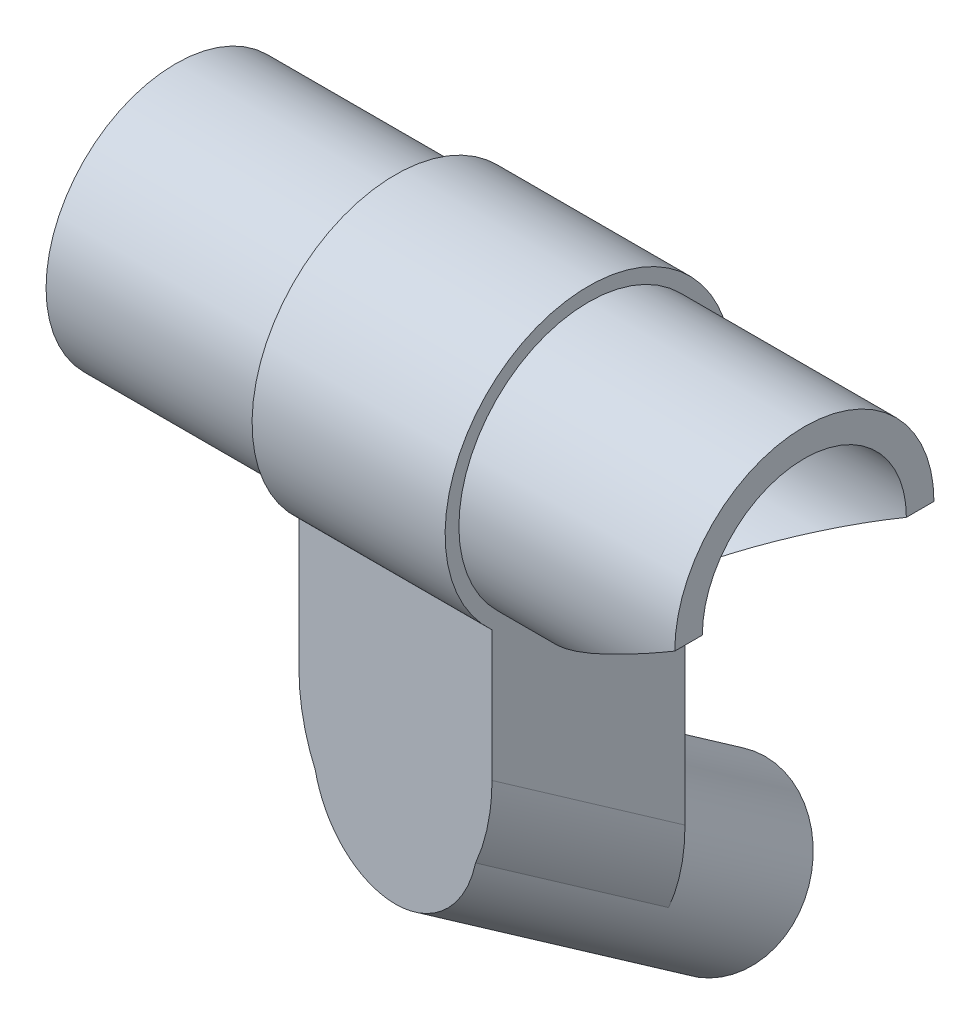
ISO-10303-21;
HEADER;
FILE_DESCRIPTION(('STEP AP214'),'2;1');
FILE_NAME('part.step','',(''),(''),'','','');
FILE_SCHEMA(('AUTOMOTIVE_DESIGN { 1 0 10303 214 1 1 1 1 }'));
ENDSEC;
DATA;
#1=APPLICATION_CONTEXT('core data for automotive mechanical design processes');
#2=APPLICATION_PROTOCOL_DEFINITION('international standard','automotive_design',2000,#1);
#3=PRODUCT_CONTEXT('',#1,'mechanical');
#4=PRODUCT('Part','Part','',(#3));
#5=PRODUCT_RELATED_PRODUCT_CATEGORY('part','',(#4));
#6=PRODUCT_DEFINITION_FORMATION('','',#4);
#7=PRODUCT_DEFINITION_CONTEXT('part definition',#1,'design');
#8=PRODUCT_DEFINITION('design','',#6,#7);
#9=PRODUCT_DEFINITION_SHAPE('','',#8);
#10=(LENGTH_UNIT() NAMED_UNIT(*) SI_UNIT(.MILLI.,.METRE.));
#11=(NAMED_UNIT(*) PLANE_ANGLE_UNIT() SI_UNIT($,.RADIAN.));
#12=(NAMED_UNIT(*) SI_UNIT($,.STERADIAN.) SOLID_ANGLE_UNIT());
#13=UNCERTAINTY_MEASURE_WITH_UNIT(LENGTH_MEASURE(1.E-05),#10,'distance_accuracy_value','');
#14=(GEOMETRIC_REPRESENTATION_CONTEXT(3) GLOBAL_UNCERTAINTY_ASSIGNED_CONTEXT((#13)) GLOBAL_UNIT_ASSIGNED_CONTEXT((#10,
#11,#12)) REPRESENTATION_CONTEXT('',''));
#15=CARTESIAN_POINT('',(0.,0.,0.));
#16=DIRECTION('',(0.,0.,1.));
#17=DIRECTION('',(1.,0.,0.));
#18=AXIS2_PLACEMENT_3D('',#15,#16,#17);
#19=CARTESIAN_POINT('',(114.,0.,0.));
#20=DIRECTION('',(-1.,0.,0.));
#21=DIRECTION('',(0.,0.,1.));
#22=AXIS2_PLACEMENT_3D('',#19,#20,#21);
#23=CYLINDRICAL_SURFACE('',#22,23.5);
#24=CARTESIAN_POINT('',(114.,0.,0.));
#25=DIRECTION('',(-0.506549048630866,0.862211146605728,0.));
#26=DIRECTION('',(-0.862211146605728,-0.506549048630866,0.));
#27=AXIS2_PLACEMENT_3D('',#24,#25,#26);
#28=ELLIPSE('',#27,46.3923485070545,23.5);
#29=CARTESIAN_POINT('',(114.,0.,-23.5));
#30=VERTEX_POINT('',#29);
#31=CARTESIAN_POINT('',(74.857864376269,-22.996004678942,-4.84084381137014));
#32=VERTEX_POINT('',#31);
#33=EDGE_CURVE('E228',#30,#32,#28,.T.);
#34=ORIENTED_EDGE('',*,*,#33,.T.);
#35=CARTESIAN_POINT('',(74.857864376269,0.,0.));
#36=DIRECTION('',(1.,0.,0.));
#37=DIRECTION('',(0.,0.,-1.));
#38=AXIS2_PLACEMENT_3D('',#35,#36,#37);
#39=CIRCLE('',#38,23.5);
#40=CARTESIAN_POINT('',(74.857864376269,-22.996004678942,4.84084381137014));
#41=VERTEX_POINT('',#40);
#42=EDGE_CURVE('E156',#32,#41,#39,.T.);
#43=ORIENTED_EDGE('',*,*,#42,.T.);
#44=CARTESIAN_POINT('',(114.,0.,23.5));
#45=VERTEX_POINT('',#44);
#46=EDGE_CURVE('E223',#41,#45,#28,.T.);
#47=ORIENTED_EDGE('',*,*,#46,.T.);
#48=CARTESIAN_POINT('',(114.,0.,0.));
#49=DIRECTION('',(1.,0.,0.));
#50=DIRECTION('',(0.,0.,-1.));
#51=AXIS2_PLACEMENT_3D('',#48,#49,#50);
#52=CIRCLE('',#51,23.5);
#53=EDGE_CURVE('E220',#30,#45,#52,.T.);
#54=ORIENTED_EDGE('',*,*,#53,.F.);
#55=EDGE_LOOP('',(#34,#43,#47,#54));
#56=FACE_BOUND('',#55,.T.);
#57=ADVANCED_FACE('F41',(#56),#23,.T.);
#58=CARTESIAN_POINT('',(57.3578643762691,-53.528471272979,16.3830408857798));
#59=DIRECTION('',(0.,-0.573576436351047,-0.819152044288991));
#60=DIRECTION('',(0.,0.819152044288991,-0.573576436351047));
#61=AXIS2_PLACEMENT_3D('',#58,#59,#60);
#62=CYLINDRICAL_SURFACE('',#61,15.);
#63=CARTESIAN_POINT('',(57.3578643762691,-52.74636808133,17.5));
#64=DIRECTION('',(0.,0.,-1.));
#65=DIRECTION('',(0.,-1.,0.));
#66=AXIS2_PLACEMENT_3D('',#63,#64,#65);
#67=ELLIPSE('',#66,18.3116188314219,15.);
#68=CARTESIAN_POINT('',(42.8328248813325,-57.3178759650479,17.5));
#69=VERTEX_POINT('',#68);
#70=CARTESIAN_POINT('',(71.8801980875455,-57.3306690174823,17.5));
#71=VERTEX_POINT('',#70);
#72=EDGE_CURVE('E114',#69,#71,#67,.F.);
#73=ORIENTED_EDGE('',*,*,#72,.F.);
#74=DIRECTION('',(0.,-0.573576436351047,-0.819152044288991));
#75=VECTOR('',#74,1.);
#76=CARTESIAN_POINT('',(42.8328248813325,-56.5959991056397,18.530946997877));
#77=LINE('',#76,#75);
#78=CARTESIAN_POINT('',(42.8328248813324,-81.8251398023878,-17.5));
#79=VERTEX_POINT('',#78);
#80=EDGE_CURVE('E124',#69,#79,#77,.T.);
#81=ORIENTED_EDGE('',*,*,#80,.T.);
#82=CARTESIAN_POINT('',(57.357864376269,-77.25363191867,-17.5));
#83=DIRECTION('',(0.,0.,-1.));
#84=DIRECTION('',(0.,-1.,0.));
#85=AXIS2_PLACEMENT_3D('',#82,#83,#84);
#86=ELLIPSE('',#85,18.3116188314219,15.);
#87=CARTESIAN_POINT('',(71.8801980875453,-81.8379328548222,-17.5));
#88=VERTEX_POINT('',#87);
#89=EDGE_CURVE('E160',#79,#88,#86,.T.);
#90=ORIENTED_EDGE('',*,*,#89,.T.);
#91=DIRECTION('',(0.,-0.573576436351047,-0.819152044288991));
#92=VECTOR('',#91,1.);
#93=CARTESIAN_POINT('',(71.8801980875455,-56.6045833726706,18.5369577663619));
#94=LINE('',#93,#92);
#95=EDGE_CURVE('E126',#88,#71,#94,.F.);
#96=ORIENTED_EDGE('',*,*,#95,.T.);
#97=EDGE_LOOP('',(#73,#81,#90,#96));
#98=FACE_BOUND('',#97,.T.);
#99=CARTESIAN_POINT('',(57.3578643762689,-93.6788218175524,-40.9576022144496));
#100=DIRECTION('',(0.,-0.573576436351047,-0.819152044288991));
#101=DIRECTION('',(0.,0.819152044288991,-0.573576436351047));
#102=AXIS2_PLACEMENT_3D('',#99,#100,#101);
#103=CIRCLE('',#102,15.);
#104=CARTESIAN_POINT('',(57.3578643762689,-81.3915411532175,-49.5612487597153));
#105=VERTEX_POINT('',#104);
#106=EDGE_CURVE('E168',#105,#105,#103,.T.);
#107=ORIENTED_EDGE('',*,*,#106,.F.);
#108=EDGE_LOOP('',(#107));
#109=FACE_BOUND('',#108,.T.);
#110=ADVANCED_FACE('F121',(#98,#109),#62,.T.);
#111=CARTESIAN_POINT('',(57.3578643762691,-53.528471272979,16.3830408857798));
#112=DIRECTION('',(0.,-0.573576436351047,-0.819152044288991));
#113=DIRECTION('',(0.,0.819152044288991,-0.573576436351047));
#114=AXIS2_PLACEMENT_3D('',#111,#112,#113);
#115=CYLINDRICAL_SURFACE('',#114,12.5);
#116=CARTESIAN_POINT('',(57.3578643762689,-93.6788218175524,-40.9576022144496));
#117=DIRECTION('',(0.,-0.573576436351047,-0.819152044288991));
#118=DIRECTION('',(0.,0.819152044288991,-0.573576436351047));
#119=AXIS2_PLACEMENT_3D('',#116,#117,#118);
#120=CIRCLE('',#119,12.5);
#121=CARTESIAN_POINT('',(57.3578643762689,-83.43942126394,-48.1273076688376));
#122=VERTEX_POINT('',#121);
#123=EDGE_CURVE('E296',#122,#122,#120,.T.);
#124=ORIENTED_EDGE('',*,*,#123,.T.);
#125=EDGE_LOOP('',(#124));
#126=FACE_BOUND('',#125,.T.);
#127=CARTESIAN_POINT('',(57.357864376269,-77.25363191867,-17.5));
#128=DIRECTION('',(0.,0.,-1.));
#129=DIRECTION('',(0.,-1.,0.));
#130=AXIS2_PLACEMENT_3D('',#127,#128,#129);
#131=ELLIPSE('',#130,15.2596823595182,12.5);
#132=CARTESIAN_POINT('',(57.3578643762689,-92.5133142781882,-17.5));
#133=VERTEX_POINT('',#132);
#134=EDGE_CURVE('E163',#133,#133,#131,.T.);
#135=ORIENTED_EDGE('',*,*,#134,.F.);
#136=EDGE_LOOP('',(#135));
#137=FACE_BOUND('',#136,.T.);
#138=ADVANCED_FACE('F270',(#126,#137),#115,.F.);
#139=CARTESIAN_POINT('',(39.857864376269,-65.,-17.5));
#140=DIRECTION('',(0.,0.,-1.));
#141=DIRECTION('',(-1.,0.,0.));
#142=AXIS2_PLACEMENT_3D('',#139,#140,#141);
#143=PLANE('',#142);
#144=ORIENTED_EDGE('',*,*,#134,.T.);
#145=EDGE_LOOP('',(#144));
#146=FACE_BOUND('',#145,.T.);
#147=ADVANCED_FACE('F259',(#146),#143,.T.);
#148=CARTESIAN_POINT('',(5.,0.,0.));
#149=DIRECTION('',(-1.,0.,0.));
#150=DIRECTION('',(0.,0.,1.));
#151=AXIS2_PLACEMENT_3D('',#148,#149,#150);
#152=CYLINDRICAL_SURFACE('',#151,5.37499999999997);
#153=CARTESIAN_POINT('',(0.,0.,0.));
#154=DIRECTION('',(-1.,0.,0.));
#155=DIRECTION('',(0.,0.,1.));
#156=AXIS2_PLACEMENT_3D('',#153,#154,#155);
#157=CIRCLE('',#156,5.37499999999997);
#158=CARTESIAN_POINT('',(0.,0.,5.37499999999997));
#159=VERTEX_POINT('',#158);
#160=EDGE_CURVE('E210',#159,#159,#157,.T.);
#161=ORIENTED_EDGE('',*,*,#160,.T.);
#162=EDGE_LOOP('',(#161));
#163=FACE_BOUND('',#162,.T.);
#164=CARTESIAN_POINT('',(2.5,0.,0.));
#165=DIRECTION('',(1.,0.,0.));
#166=DIRECTION('',(0.,0.,-1.));
#167=AXIS2_PLACEMENT_3D('',#164,#165,#166);
#168=CIRCLE('',#167,5.37499999999997);
#169=CARTESIAN_POINT('',(2.5,0.,-5.37499999999997));
#170=VERTEX_POINT('',#169);
#171=EDGE_CURVE('E180',#170,#170,#168,.F.);
#172=ORIENTED_EDGE('',*,*,#171,.F.);
#173=EDGE_LOOP('',(#172));
#174=FACE_BOUND('',#173,.T.);
#175=ADVANCED_FACE('F248',(#163,#174),#152,.F.);
#176=CARTESIAN_POINT('',(114.,0.,0.));
#177=DIRECTION('',(-1.,0.,0.));
#178=DIRECTION('',(0.,0.,1.));
#179=AXIS2_PLACEMENT_3D('',#176,#177,#178);
#180=CYLINDRICAL_SURFACE('',#179,18.5);
#181=CARTESIAN_POINT('',(5.,0.,0.));
#182=DIRECTION('',(-1.,0.,0.));
#183=DIRECTION('',(0.,0.,1.));
#184=AXIS2_PLACEMENT_3D('',#181,#182,#183);
#185=CIRCLE('',#184,18.5);
#186=CARTESIAN_POINT('',(5.,0.,18.5));
#187=VERTEX_POINT('',#186);
#188=EDGE_CURVE('E215',#187,#187,#185,.T.);
#189=ORIENTED_EDGE('',*,*,#188,.T.);
#190=EDGE_LOOP('',(#189));
#191=FACE_BOUND('',#190,.T.);
#192=CARTESIAN_POINT('',(114.,0.,0.));
#193=DIRECTION('',(-0.506549048630866,0.862211146605728,0.));
#194=DIRECTION('',(-0.862211146605728,-0.506549048630866,0.));
#195=AXIS2_PLACEMENT_3D('',#192,#193,#194);
#196=ELLIPSE('',#195,36.521636058745,18.5);
#197=CARTESIAN_POINT('',(114.,0.,-18.5));
#198=VERTEX_POINT('',#197);
#199=CARTESIAN_POINT('',(114.,0.,18.5));
#200=VERTEX_POINT('',#199);
#201=EDGE_CURVE('E185',#198,#200,#196,.T.);
#202=ORIENTED_EDGE('',*,*,#201,.F.);
#203=CARTESIAN_POINT('',(114.,0.,0.));
#204=DIRECTION('',(1.,0.,0.));
#205=DIRECTION('',(0.,0.,-1.));
#206=AXIS2_PLACEMENT_3D('',#203,#204,#205);
#207=CIRCLE('',#206,18.5);
#208=EDGE_CURVE('E216',#198,#200,#207,.T.);
#209=ORIENTED_EDGE('',*,*,#208,.T.);
#210=EDGE_LOOP('',(#202,#209));
#211=FACE_BOUND('',#210,.T.);
#212=ADVANCED_FACE('F246',(#191,#211),#180,.F.);
#213=CARTESIAN_POINT('',(114.,0.,0.));
#214=DIRECTION('',(1.,0.,0.));
#215=DIRECTION('',(0.,0.,-1.));
#216=AXIS2_PLACEMENT_3D('',#213,#214,#215);
#217=PLANE('',#216);
#218=DIRECTION('',(0.,0.,1.));
#219=VECTOR('',#218,1.);
#220=CARTESIAN_POINT('',(114.,0.,-23.5));
#221=LINE('',#220,#219);
#222=EDGE_CURVE('E183',#30,#198,#221,.T.);
#223=ORIENTED_EDGE('',*,*,#222,.F.);
#224=ORIENTED_EDGE('',*,*,#53,.T.);
#225=EDGE_CURVE('E186',#200,#45,#221,.T.);
#226=ORIENTED_EDGE('',*,*,#225,.F.);
#227=ORIENTED_EDGE('',*,*,#208,.F.);
#228=EDGE_LOOP('',(#223,#224,#226,#227));
#229=FACE_BOUND('',#228,.T.);
#230=ADVANCED_FACE('F242',(#229),#217,.T.);
#231=CARTESIAN_POINT('',(0.,0.,0.));
#232=DIRECTION('',(1.,0.,0.));
#233=DIRECTION('',(0.,0.,-1.));
#234=AXIS2_PLACEMENT_3D('',#231,#232,#233);
#235=PLANE('',#234);
#236=CARTESIAN_POINT('',(0.,0.,0.));
#237=DIRECTION('',(1.,0.,0.));
#238=DIRECTION('',(0.,0.,-1.));
#239=AXIS2_PLACEMENT_3D('',#236,#237,#238);
#240=CIRCLE('',#239,23.5);
#241=CARTESIAN_POINT('',(0.,0.,23.5));
#242=VERTEX_POINT('',#241);
#243=EDGE_CURVE('E219',#242,#242,#240,.T.);
#244=ORIENTED_EDGE('',*,*,#243,.F.);
#245=EDGE_LOOP('',(#244));
#246=FACE_BOUND('',#245,.T.);
#247=ORIENTED_EDGE('',*,*,#160,.F.);
#248=EDGE_LOOP('',(#247));
#249=FACE_BOUND('',#248,.T.);
#250=CARTESIAN_POINT('',(0.,6.35166331923901,-12.4762323269907));
#251=DIRECTION('',(-1.,0.,0.));
#252=DIRECTION('',(0.,0.,1.));
#253=AXIS2_PLACEMENT_3D('',#250,#251,#252);
#254=CIRCLE('',#253,1.24999999999999);
#255=CARTESIAN_POINT('',(0.,6.35166331923901,-11.2262323269907));
#256=VERTEX_POINT('',#255);
#257=EDGE_CURVE('E204',#256,#256,#254,.T.);
#258=ORIENTED_EDGE('',*,*,#257,.F.);
#259=EDGE_LOOP('',(#258));
#260=FACE_BOUND('',#259,.T.);
#261=CARTESIAN_POINT('',(0.,-12.4762323270948,-6.35166331923473));
#262=DIRECTION('',(-1.,0.,0.));
#263=DIRECTION('',(0.,0.,1.));
#264=AXIS2_PLACEMENT_3D('',#261,#262,#263);
#265=CIRCLE('',#264,1.24999999999999);
#266=CARTESIAN_POINT('',(0.,-12.4762323270948,-5.10166331923475));
#267=VERTEX_POINT('',#266);
#268=EDGE_CURVE('E198',#267,#267,#265,.T.);
#269=ORIENTED_EDGE('',*,*,#268,.F.);
#270=EDGE_LOOP('',(#269));
#271=FACE_BOUND('',#270,.T.);
#272=CARTESIAN_POINT('',(0.,-6.35166331933882,12.4762323270991));
#273=DIRECTION('',(-1.,0.,0.));
#274=DIRECTION('',(0.,0.,1.));
#275=AXIS2_PLACEMENT_3D('',#272,#273,#274);
#276=CIRCLE('',#275,1.24999999999999);
#277=CARTESIAN_POINT('',(0.,-6.35166331933882,13.726232327099));
#278=VERTEX_POINT('',#277);
#279=EDGE_CURVE('E192',#278,#278,#276,.T.);
#280=ORIENTED_EDGE('',*,*,#279,.F.);
#281=EDGE_LOOP('',(#280));
#282=FACE_BOUND('',#281,.T.);
#283=CARTESIAN_POINT('',(0.,12.476232326995,6.35166331934309));
#284=DIRECTION('',(-1.,0.,0.));
#285=DIRECTION('',(0.,0.,1.));
#286=AXIS2_PLACEMENT_3D('',#283,#284,#285);
#287=CIRCLE('',#286,1.24999999999999);
#288=CARTESIAN_POINT('',(0.,12.476232326995,7.60166331934308));
#289=VERTEX_POINT('',#288);
#290=EDGE_CURVE('E188',#289,#289,#287,.T.);
#291=ORIENTED_EDGE('',*,*,#290,.F.);
#292=EDGE_LOOP('',(#291));
#293=FACE_BOUND('',#292,.T.);
#294=ADVANCED_FACE('F256',(#246,#249,#260,#271,#282,#293),#235,.F.);
#295=CARTESIAN_POINT('',(39.857864376269,0.,0.));
#296=DIRECTION('',(-1.,0.,0.));
#297=DIRECTION('',(0.,0.,1.));
#298=AXIS2_PLACEMENT_3D('',#295,#296,#297);
#299=CIRCLE('',#298,23.5);
#300=CARTESIAN_POINT('',(39.8578643762691,0.,23.5));
#301=VERTEX_POINT('',#300);
#302=EDGE_CURVE('E130',#301,#301,#299,.T.);
#303=CARTESIAN_POINT('',(0.,0.,23.5));
#304=CARTESIAN_POINT('',(0.415186087252805,0.,23.5));
#305=CARTESIAN_POINT('',(0.83037217450561,0.,23.5));
#306=CARTESIAN_POINT('',(1.66074434901121,0.,23.5));
#307=CARTESIAN_POINT('',(2.07593043626401,0.,23.5));
#308=CARTESIAN_POINT('',(2.90630261076962,0.,23.5));
#309=CARTESIAN_POINT('',(3.32148869802242,0.,23.5));
#310=CARTESIAN_POINT('',(4.15186087252803,0.,23.5));
#311=CARTESIAN_POINT('',(4.56704695978083,0.,23.5));
#312=CARTESIAN_POINT('',(5.39741913428643,0.,23.5));
#313=CARTESIAN_POINT('',(5.81260522153924,0.,23.5));
#314=CARTESIAN_POINT('',(6.64297739604484,0.,23.5));
#315=CARTESIAN_POINT('',(7.05816348329764,0.,23.5));
#316=CARTESIAN_POINT('',(7.88853565780325,0.,23.5));
#317=CARTESIAN_POINT('',(8.30372174505605,0.,23.5));
#318=CARTESIAN_POINT('',(9.13409391956166,0.,23.5));
#319=CARTESIAN_POINT('',(9.54928000681446,0.,23.5));
#320=CARTESIAN_POINT('',(10.3796521813201,0.,23.5));
#321=CARTESIAN_POINT('',(10.7948382685729,0.,23.5));
#322=CARTESIAN_POINT('',(11.6252104430785,0.,23.5));
#323=CARTESIAN_POINT('',(12.0403965303313,0.,23.5));
#324=CARTESIAN_POINT('',(12.8707687048369,0.,23.5));
#325=CARTESIAN_POINT('',(13.2859547920897,0.,23.5));
#326=CARTESIAN_POINT('',(14.1163269665953,0.,23.5));
#327=CARTESIAN_POINT('',(14.5315130538481,0.,23.5));
#328=CARTESIAN_POINT('',(15.3618852283537,0.,23.5));
#329=CARTESIAN_POINT('',(15.7770713156065,0.,23.5));
#330=CARTESIAN_POINT('',(16.6074434901121,0.,23.5));
#331=CARTESIAN_POINT('',(17.0226295773649,0.,23.5));
#332=CARTESIAN_POINT('',(17.8530017518705,0.,23.5));
#333=CARTESIAN_POINT('',(18.2681878391233,0.,23.5));
#334=CARTESIAN_POINT('',(19.0985600136289,0.,23.5));
#335=CARTESIAN_POINT('',(19.5137461008817,0.,23.5));
#336=CARTESIAN_POINT('',(20.3441182753873,0.,23.5));
#337=CARTESIAN_POINT('',(20.7593043626401,0.,23.5));
#338=CARTESIAN_POINT('',(21.5896765371457,0.,23.5));
#339=CARTESIAN_POINT('',(22.0048626243985,0.,23.5));
#340=CARTESIAN_POINT('',(22.8352347989041,0.,23.5));
#341=CARTESIAN_POINT('',(23.250420886157,0.,23.5));
#342=CARTESIAN_POINT('',(24.0807930606626,0.,23.5));
#343=CARTESIAN_POINT('',(24.4959791479154,0.,23.5));
#344=CARTESIAN_POINT('',(25.326351322421,0.,23.5));
#345=CARTESIAN_POINT('',(25.7415374096738,0.,23.5));
#346=CARTESIAN_POINT('',(26.5719095841794,0.,23.5));
#347=CARTESIAN_POINT('',(26.9870956714322,0.,23.5));
#348=CARTESIAN_POINT('',(27.8174678459378,0.,23.5));
#349=CARTESIAN_POINT('',(28.2326539331906,0.,23.5));
#350=CARTESIAN_POINT('',(29.0630261076962,0.,23.5));
#351=CARTESIAN_POINT('',(29.478212194949,0.,23.5));
#352=CARTESIAN_POINT('',(30.3085843694546,0.,23.5));
#353=CARTESIAN_POINT('',(30.7237704567074,0.,23.5));
#354=CARTESIAN_POINT('',(31.554142631213,0.,23.5));
#355=CARTESIAN_POINT('',(31.9693287184658,0.,23.5));
#356=CARTESIAN_POINT('',(32.7997008929714,0.,23.5));
#357=CARTESIAN_POINT('',(33.2148869802242,0.,23.5));
#358=CARTESIAN_POINT('',(34.0452591547298,0.,23.5));
#359=CARTESIAN_POINT('',(34.4604452419826,0.,23.5));
#360=CARTESIAN_POINT('',(35.2908174164882,0.,23.5));
#361=CARTESIAN_POINT('',(35.706003503741,0.,23.5));
#362=CARTESIAN_POINT('',(36.5363756782466,0.,23.5));
#363=CARTESIAN_POINT('',(36.9515617654994,0.,23.5));
#364=CARTESIAN_POINT('',(37.7819339400051,0.,23.5));
#365=CARTESIAN_POINT('',(38.1971200272579,0.,23.5));
#366=CARTESIAN_POINT('',(39.0274922017635,0.,23.5));
#367=CARTESIAN_POINT('',(39.4426782890163,0.,23.5));
#368=CARTESIAN_POINT('',(39.8578643762691,0.,23.5));
#369=B_SPLINE_CURVE_WITH_KNOTS('',3,(#303,#304,#305,#306,#307,#308,#309,#310,#311,#312,#313,
#314,#315,#316,#317,#318,#319,#320,#321,#322,#323,#324,#325,#326,#327,#328,#329,#330,#331,#332,
#333,#334,#335,#336,#337,#338,#339,#340,#341,#342,#343,#344,#345,#346,#347,#348,#349,#350,#351,
#352,#353,#354,#355,#356,#357,#358,#359,#360,#361,#362,#363,#364,#365,#366,#367,#368),
.UNSPECIFIED.,.F.,.F.,(4,2,2,2,2,2,2,2,2,2,2,2,2,2,2,2,2,2,2,2,2,2,2,2,2,2,2,2,2,2,2,2,4),(0.,
1.24555826175841,2.49111652351681,3.73667478527523,4.98223304703363,6.22779130879204,
7.47334957055044,8.71890783230886,9.96446609406726,11.2100243558257,12.4555826175841,
13.7011408793425,14.9466991411009,16.1922574028593,17.4378156646177,18.6833739263761,
19.9289321881345,21.1744904498929,22.4200487116513,23.6656069734098,24.9111652351682,
26.1567234969266,27.402281758685,28.6478400204434,29.8933982822018,31.1389565439602,
32.3845148057186,33.630073067477,34.8756313292354,36.1211895909938,37.3667478527522,
38.6123061145107,39.8578643762691),.UNSPECIFIED.);
#370=EDGE_CURVE('BSEAM265',#242,#301,#369,.T.);
#371=ORIENTED_EDGE('',*,*,#243,.T.);
#372=ORIENTED_EDGE('',*,*,#302,.T.);
#373=ORIENTED_EDGE('',*,*,#370,.T.);
#374=ORIENTED_EDGE('',*,*,#370,.F.);
#375=EDGE_LOOP('',(#371,#373,#372,#374));
#376=FACE_BOUND('',#375,.T.);
#377=ADVANCED_FACE('F265',(#376),#23,.T.);
#378=CARTESIAN_POINT('',(5.,0.,0.));
#379=DIRECTION('',(-1.,0.,0.));
#380=DIRECTION('',(0.,0.,1.));
#381=AXIS2_PLACEMENT_3D('',#378,#379,#380);
#382=PLANE('',#381);
#383=CARTESIAN_POINT('',(5.,-4.99034579325564E-11,5.41864209752108E-11));
#384=DIRECTION('',(1.,0.,0.));
#385=DIRECTION('',(0.,0.,-1.));
#386=AXIS2_PLACEMENT_3D('',#383,#384,#385);
#387=CIRCLE('',#386,11.5000000000663);
#388=CARTESIAN_POINT('',(5.,-4.99034579325564E-11,-11.5000000000121));
#389=VERTEX_POINT('',#388);
#390=EDGE_CURVE('E176',#389,#389,#387,.T.);
#391=ORIENTED_EDGE('',*,*,#390,.F.);
#392=EDGE_LOOP('',(#391));
#393=FACE_BOUND('',#392,.T.);
#394=CARTESIAN_POINT('',(5.,6.35166331923901,-12.4762323269907));
#395=DIRECTION('',(-1.,0.,0.));
#396=DIRECTION('',(0.,0.,1.));
#397=AXIS2_PLACEMENT_3D('',#394,#395,#396);
#398=CIRCLE('',#397,1.24999999999999);
#399=CARTESIAN_POINT('',(5.,6.35166331923901,-11.2262323269907));
#400=VERTEX_POINT('',#399);
#401=EDGE_CURVE('E207',#400,#400,#398,.T.);
#402=ORIENTED_EDGE('',*,*,#401,.T.);
#403=EDGE_LOOP('',(#402));
#404=FACE_BOUND('',#403,.T.);
#405=CARTESIAN_POINT('',(5.,-12.4762323270948,-6.35166331923473));
#406=DIRECTION('',(-1.,0.,0.));
#407=DIRECTION('',(0.,0.,1.));
#408=AXIS2_PLACEMENT_3D('',#405,#406,#407);
#409=CIRCLE('',#408,1.24999999999999);
#410=CARTESIAN_POINT('',(5.,-12.4762323270948,-5.10166331923475));
#411=VERTEX_POINT('',#410);
#412=EDGE_CURVE('E201',#411,#411,#409,.T.);
#413=ORIENTED_EDGE('',*,*,#412,.T.);
#414=EDGE_LOOP('',(#413));
#415=FACE_BOUND('',#414,.T.);
#416=CARTESIAN_POINT('',(5.,-6.35166331933882,12.4762323270991));
#417=DIRECTION('',(-1.,0.,0.));
#418=DIRECTION('',(0.,0.,1.));
#419=AXIS2_PLACEMENT_3D('',#416,#417,#418);
#420=CIRCLE('',#419,1.24999999999999);
#421=CARTESIAN_POINT('',(5.,-6.35166331933882,13.726232327099));
#422=VERTEX_POINT('',#421);
#423=EDGE_CURVE('E195',#422,#422,#420,.T.);
#424=ORIENTED_EDGE('',*,*,#423,.T.);
#425=EDGE_LOOP('',(#424));
#426=FACE_BOUND('',#425,.T.);
#427=CARTESIAN_POINT('',(5.,12.476232326995,6.35166331934309));
#428=DIRECTION('',(-1.,0.,0.));
#429=DIRECTION('',(0.,0.,1.));
#430=AXIS2_PLACEMENT_3D('',#427,#428,#429);
#431=CIRCLE('',#430,1.24999999999999);
#432=CARTESIAN_POINT('',(5.,12.476232326995,7.60166331934308));
#433=VERTEX_POINT('',#432);
#434=EDGE_CURVE('E189',#433,#433,#431,.T.);
#435=ORIENTED_EDGE('',*,*,#434,.T.);
#436=EDGE_LOOP('',(#435));
#437=FACE_BOUND('',#436,.T.);
#438=ORIENTED_EDGE('',*,*,#188,.F.);
#439=EDGE_LOOP('',(#438));
#440=FACE_BOUND('',#439,.T.);
#441=ADVANCED_FACE('F273',(#393,#404,#415,#426,#437,#440),#382,.F.);
#442=CARTESIAN_POINT('',(5.,6.35166331923901,-12.4762323269907));
#443=DIRECTION('',(-1.,0.,0.));
#444=DIRECTION('',(0.,0.,1.));
#445=AXIS2_PLACEMENT_3D('',#442,#443,#444);
#446=CYLINDRICAL_SURFACE('',#445,1.24999999999999);
#447=ORIENTED_EDGE('',*,*,#401,.F.);
#448=EDGE_LOOP('',(#447));
#449=FACE_BOUND('',#448,.T.);
#450=ORIENTED_EDGE('',*,*,#257,.T.);
#451=EDGE_LOOP('',(#450));
#452=FACE_BOUND('',#451,.T.);
#453=ADVANCED_FACE('F278',(#449,#452),#446,.F.);
#454=CARTESIAN_POINT('',(5.,-12.4762323270948,-6.35166331923473));
#455=DIRECTION('',(-1.,0.,0.));
#456=DIRECTION('',(0.,0.,1.));
#457=AXIS2_PLACEMENT_3D('',#454,#455,#456);
#458=CYLINDRICAL_SURFACE('',#457,1.24999999999999);
#459=ORIENTED_EDGE('',*,*,#412,.F.);
#460=EDGE_LOOP('',(#459));
#461=FACE_BOUND('',#460,.T.);
#462=ORIENTED_EDGE('',*,*,#268,.T.);
#463=EDGE_LOOP('',(#462));
#464=FACE_BOUND('',#463,.T.);
#465=ADVANCED_FACE('F338',(#461,#464),#458,.F.);
#466=CARTESIAN_POINT('',(5.,-6.35166331933882,12.4762323270991));
#467=DIRECTION('',(-1.,0.,0.));
#468=DIRECTION('',(0.,0.,1.));
#469=AXIS2_PLACEMENT_3D('',#466,#467,#468);
#470=CYLINDRICAL_SURFACE('',#469,1.24999999999999);
#471=ORIENTED_EDGE('',*,*,#423,.F.);
#472=EDGE_LOOP('',(#471));
#473=FACE_BOUND('',#472,.T.);
#474=ORIENTED_EDGE('',*,*,#279,.T.);
#475=EDGE_LOOP('',(#474));
#476=FACE_BOUND('',#475,.T.);
#477=ADVANCED_FACE('F334',(#473,#476),#470,.F.);
#478=CARTESIAN_POINT('',(5.,12.476232326995,6.35166331934309));
#479=DIRECTION('',(-1.,0.,0.));
#480=DIRECTION('',(0.,0.,1.));
#481=AXIS2_PLACEMENT_3D('',#478,#479,#480);
#482=CYLINDRICAL_SURFACE('',#481,1.24999999999999);
#483=ORIENTED_EDGE('',*,*,#434,.F.);
#484=EDGE_LOOP('',(#483));
#485=FACE_BOUND('',#484,.T.);
#486=ORIENTED_EDGE('',*,*,#290,.T.);
#487=EDGE_LOOP('',(#486));
#488=FACE_BOUND('',#487,.T.);
#489=ADVANCED_FACE('F331',(#485,#488),#482,.F.);
#490=CARTESIAN_POINT('',(114.,0.,-23.5));
#491=DIRECTION('',(-0.506549048630866,0.862211146605728,0.));
#492=DIRECTION('',(-0.862211146605728,-0.506549048630866,0.));
#493=AXIS2_PLACEMENT_3D('',#490,#491,#492);
#494=PLANE('',#493);
#495=ORIENTED_EDGE('',*,*,#46,.F.);
#496=DIRECTION('',(0.,0.,-1.));
#497=VECTOR('',#496,1.);
#498=CARTESIAN_POINT('',(74.857864376269,-22.996004678942,-23.5));
#499=LINE('',#498,#497);
#500=EDGE_CURVE('E135',#41,#32,#499,.T.);
#501=ORIENTED_EDGE('',*,*,#500,.T.);
#502=ORIENTED_EDGE('',*,*,#33,.F.);
#503=ORIENTED_EDGE('',*,*,#222,.T.);
#504=ORIENTED_EDGE('',*,*,#201,.T.);
#505=ORIENTED_EDGE('',*,*,#225,.T.);
#506=EDGE_LOOP('',(#495,#501,#502,#503,#504,#505));
#507=FACE_BOUND('',#506,.T.);
#508=ADVANCED_FACE('F235',(#507),#494,.F.);
#509=CARTESIAN_POINT('',(2.5,-4.99034579325564E-11,5.41864209752108E-11));
#510=DIRECTION('',(1.,0.,0.));
#511=DIRECTION('',(0.,0.,-1.));
#512=AXIS2_PLACEMENT_3D('',#509,#510,#511);
#513=PLANE('',#512);
#514=CARTESIAN_POINT('',(2.5,-4.99034579325564E-11,5.41864209752108E-11));
#515=DIRECTION('',(1.,0.,0.));
#516=DIRECTION('',(0.,0.,-1.));
#517=AXIS2_PLACEMENT_3D('',#514,#515,#516);
#518=CIRCLE('',#517,11.5000000000663);
#519=CARTESIAN_POINT('',(2.5,-4.99034579325564E-11,-11.5000000000121));
#520=VERTEX_POINT('',#519);
#521=EDGE_CURVE('E177',#520,#520,#518,.T.);
#522=ORIENTED_EDGE('',*,*,#521,.T.);
#523=EDGE_LOOP('',(#522));
#524=FACE_BOUND('',#523,.T.);
#525=ORIENTED_EDGE('',*,*,#171,.T.);
#526=EDGE_LOOP('',(#525));
#527=FACE_BOUND('',#526,.T.);
#528=ADVANCED_FACE('F322',(#524,#527),#513,.T.);
#529=CARTESIAN_POINT('',(2.5,-4.99034579325564E-11,5.41864209752108E-11));
#530=DIRECTION('',(1.,0.,0.));
#531=DIRECTION('',(0.,0.,-1.));
#532=AXIS2_PLACEMENT_3D('',#529,#530,#531);
#533=CYLINDRICAL_SURFACE('',#532,11.5000000000663);
#534=ORIENTED_EDGE('',*,*,#521,.F.);
#535=EDGE_LOOP('',(#534));
#536=FACE_BOUND('',#535,.T.);
#537=ORIENTED_EDGE('',*,*,#390,.T.);
#538=EDGE_LOOP('',(#537));
#539=FACE_BOUND('',#538,.T.);
#540=ADVANCED_FACE('F321',(#536,#539),#533,.F.);
#541=CARTESIAN_POINT('',(74.857864376269,-65.,-17.5));
#542=DIRECTION('',(1.,0.,0.));
#543=DIRECTION('',(0.,0.,-1.));
#544=AXIS2_PLACEMENT_3D('',#541,#542,#543);
#545=PLANE('',#544);
#546=DIRECTION('',(0.,1.,0.));
#547=VECTOR('',#546,1.);
#548=CARTESIAN_POINT('',(74.857864376269,-65.,17.5));
#549=LINE('',#548,#547);
#550=CARTESIAN_POINT('',(74.8578643762691,-42.8854017270823,17.5));
#551=VERTEX_POINT('',#550);
#552=CARTESIAN_POINT('',(74.857864376269,-19.2288845230294,17.5));
#553=VERTEX_POINT('',#552);
#554=EDGE_CURVE('E146',#551,#553,#549,.T.);
#555=ORIENTED_EDGE('',*,*,#554,.F.);
#556=DIRECTION('',(0.,0.573576436351047,0.819152044288991));
#557=VECTOR('',#556,1.);
#558=CARTESIAN_POINT('',(74.857864376269,-71.219364596069,-22.9650925944482));
#559=LINE('',#558,#557);
#560=CARTESIAN_POINT('',(74.8578643762689,-67.3926655644222,-17.5));
#561=VERTEX_POINT('',#560);
#562=EDGE_CURVE('E141',#551,#561,#559,.F.);
#563=ORIENTED_EDGE('',*,*,#562,.T.);
#564=DIRECTION('',(0.,1.,0.));
#565=VECTOR('',#564,1.);
#566=CARTESIAN_POINT('',(74.857864376269,-65.,-17.5));
#567=LINE('',#566,#565);
#568=CARTESIAN_POINT('',(74.857864376269,-19.2288845230294,-17.5));
#569=VERTEX_POINT('',#568);
#570=EDGE_CURVE('E162',#561,#569,#567,.T.);
#571=ORIENTED_EDGE('',*,*,#570,.T.);
#572=CARTESIAN_POINT('',(74.857864376269,0.,0.));
#573=DIRECTION('',(-1.,0.,0.));
#574=DIRECTION('',(0.,0.,1.));
#575=AXIS2_PLACEMENT_3D('',#572,#573,#574);
#576=CIRCLE('',#575,26.);
#577=EDGE_CURVE('E155',#553,#569,#576,.T.);
#578=ORIENTED_EDGE('',*,*,#577,.F.);
#579=EDGE_LOOP('',(#555,#563,#571,#578));
#580=FACE_BOUND('',#579,.T.);
#581=ORIENTED_EDGE('',*,*,#42,.F.);
#582=ORIENTED_EDGE('',*,*,#500,.F.);
#583=EDGE_LOOP('',(#581,#582));
#584=FACE_BOUND('',#583,.T.);
#585=ADVANCED_FACE('F151',(#580,#584),#545,.T.);
#586=ORIENTED_EDGE('',*,*,#570,.F.);
#587=CARTESIAN_POINT('',(49.8578643762689,-67.3926655644223,-17.5));
#588=DIRECTION('',(0.,0.,-1.));
#589=DIRECTION('',(0.,-1.,0.));
#590=AXIS2_PLACEMENT_3D('',#587,#588,#589);
#591=ELLIPSE('',#590,30.5193647190364,25.);
#592=EDGE_CURVE('E118',#561,#88,#591,.T.);
#593=ORIENTED_EDGE('',*,*,#592,.T.);
#594=ORIENTED_EDGE('',*,*,#89,.F.);
#595=CARTESIAN_POINT('',(64.8578643762689,-67.3860217445001,-17.5));
#596=DIRECTION('',(0.,0.,-1.));
#597=DIRECTION('',(0.,-1.,0.));
#598=AXIS2_PLACEMENT_3D('',#595,#596,#597);
#599=ELLIPSE('',#598,30.5193647190364,25.);
#600=CARTESIAN_POINT('',(39.8578643762689,-67.3860217445002,-17.5));
#601=VERTEX_POINT('',#600);
#602=EDGE_CURVE('E63',#79,#601,#599,.T.);
#603=ORIENTED_EDGE('',*,*,#602,.T.);
#604=DIRECTION('',(0.,1.,0.));
#605=VECTOR('',#604,1.);
#606=CARTESIAN_POINT('',(39.857864376269,-65.,-17.5));
#607=LINE('',#606,#605);
#608=CARTESIAN_POINT('',(39.857864376269,-19.2288845230294,-17.5));
#609=VERTEX_POINT('',#608);
#610=EDGE_CURVE('E165',#601,#609,#607,.T.);
#611=ORIENTED_EDGE('',*,*,#610,.T.);
#612=DIRECTION('',(-1.,0.,0.));
#613=VECTOR('',#612,1.);
#614=CARTESIAN_POINT('',(74.857864376269,-19.2288845230294,-17.5));
#615=LINE('',#614,#613);
#616=EDGE_CURVE('E293',#569,#609,#615,.T.);
#617=ORIENTED_EDGE('',*,*,#616,.F.);
#618=EDGE_LOOP('',(#586,#593,#594,#603,#611,#617));
#619=FACE_BOUND('',#618,.T.);
#620=ADVANCED_FACE('F159',(#619),#143,.T.);
#621=CARTESIAN_POINT('',(39.857864376269,-65.,-17.5));
#622=DIRECTION('',(-1.,0.,0.));
#623=DIRECTION('',(0.,0.,1.));
#624=AXIS2_PLACEMENT_3D('',#621,#622,#623);
#625=PLANE('',#624);
#626=ORIENTED_EDGE('',*,*,#302,.F.);
#627=EDGE_LOOP('',(#626));
#628=FACE_BOUND('',#627,.T.);
#629=ORIENTED_EDGE('',*,*,#610,.F.);
#630=DIRECTION('',(0.,0.573576436351047,0.819152044288991));
#631=VECTOR('',#630,1.);
#632=CARTESIAN_POINT('',(39.857864376269,-46.7028956620787,12.0385652878059));
#633=LINE('',#632,#631);
#634=CARTESIAN_POINT('',(39.8578643762691,-42.8787579071603,17.5));
#635=VERTEX_POINT('',#634);
#636=EDGE_CURVE('E11',#601,#635,#633,.T.);
#637=ORIENTED_EDGE('',*,*,#636,.T.);
#638=DIRECTION('',(0.,1.,0.));
#639=VECTOR('',#638,1.);
#640=CARTESIAN_POINT('',(39.857864376269,-65.,17.5));
#641=LINE('',#640,#639);
#642=CARTESIAN_POINT('',(39.857864376269,-19.2288845230294,17.5));
#643=VERTEX_POINT('',#642);
#644=EDGE_CURVE('E117',#635,#643,#641,.T.);
#645=ORIENTED_EDGE('',*,*,#644,.T.);
#646=CARTESIAN_POINT('',(39.857864376269,0.,0.));
#647=DIRECTION('',(-1.,0.,0.));
#648=DIRECTION('',(0.,0.,1.));
#649=AXIS2_PLACEMENT_3D('',#646,#647,#648);
#650=CIRCLE('',#649,26.);
#651=EDGE_CURVE('E128',#643,#609,#650,.T.);
#652=ORIENTED_EDGE('',*,*,#651,.T.);
#653=EDGE_LOOP('',(#629,#637,#645,#652));
#654=FACE_BOUND('',#653,.T.);
#655=ADVANCED_FACE('F286',(#628,#654),#625,.T.);
#656=CARTESIAN_POINT('',(39.857864376269,-65.,17.5));
#657=DIRECTION('',(0.,0.,1.));
#658=DIRECTION('',(1.,0.,0.));
#659=AXIS2_PLACEMENT_3D('',#656,#657,#658);
#660=PLANE('',#659);
#661=ORIENTED_EDGE('',*,*,#72,.T.);
#662=CARTESIAN_POINT('',(49.8578643762691,-42.8854017270824,17.5));
#663=DIRECTION('',(0.,0.,1.));
#664=DIRECTION('',(0.,-1.,0.));
#665=AXIS2_PLACEMENT_3D('',#662,#663,#664);
#666=ELLIPSE('',#665,30.5193647190364,25.);
#667=EDGE_CURVE('E49',#71,#551,#666,.T.);
#668=ORIENTED_EDGE('',*,*,#667,.T.);
#669=ORIENTED_EDGE('',*,*,#554,.T.);
#670=DIRECTION('',(-1.,0.,0.));
#671=VECTOR('',#670,1.);
#672=CARTESIAN_POINT('',(74.857864376269,-19.2288845230294,17.5));
#673=LINE('',#672,#671);
#674=EDGE_CURVE('E132',#643,#553,#673,.F.);
#675=ORIENTED_EDGE('',*,*,#674,.F.);
#676=ORIENTED_EDGE('',*,*,#644,.F.);
#677=CARTESIAN_POINT('',(64.8578643762691,-42.8787579071602,17.5));
#678=DIRECTION('',(0.,0.,1.));
#679=DIRECTION('',(0.,-1.,0.));
#680=AXIS2_PLACEMENT_3D('',#677,#678,#679);
#681=ELLIPSE('',#680,30.5193647190364,25.);
#682=EDGE_CURVE('E56',#635,#69,#681,.T.);
#683=ORIENTED_EDGE('',*,*,#682,.T.);
#684=EDGE_LOOP('',(#661,#668,#669,#675,#676,#683));
#685=FACE_BOUND('',#684,.T.);
#686=ADVANCED_FACE('F113',(#685),#660,.T.);
#687=CARTESIAN_POINT('',(57.3578643762689,-93.6788218175524,-40.9576022144496));
#688=DIRECTION('',(0.,-0.573576436351047,-0.819152044288991));
#689=DIRECTION('',(0.,0.819152044288991,-0.573576436351047));
#690=AXIS2_PLACEMENT_3D('',#687,#688,#689);
#691=PLANE('',#690);
#692=ORIENTED_EDGE('',*,*,#123,.F.);
#693=EDGE_LOOP('',(#692));
#694=FACE_BOUND('',#693,.T.);
#695=ORIENTED_EDGE('',*,*,#106,.T.);
#696=EDGE_LOOP('',(#695));
#697=FACE_BOUND('',#696,.T.);
#698=ADVANCED_FACE('F305',(#694,#697),#691,.T.);
#699=CARTESIAN_POINT('',(74.857864376269,0.,0.));
#700=DIRECTION('',(-1.,0.,0.));
#701=DIRECTION('',(0.,0.,1.));
#702=AXIS2_PLACEMENT_3D('',#699,#700,#701);
#703=CYLINDRICAL_SURFACE('',#702,26.);
#704=ORIENTED_EDGE('',*,*,#577,.T.);
#705=ORIENTED_EDGE('',*,*,#616,.T.);
#706=ORIENTED_EDGE('',*,*,#651,.F.);
#707=ORIENTED_EDGE('',*,*,#674,.T.);
#708=EDGE_LOOP('',(#704,#705,#706,#707));
#709=FACE_BOUND('',#708,.T.);
#710=ADVANCED_FACE('F295',(#709),#703,.T.);
#711=CARTESIAN_POINT('',(49.857864376269,-46.9116635329506,11.7499022273275));
#712=DIRECTION('',(0.,-0.573576436351047,-0.819152044288991));
#713=DIRECTION('',(0.,0.819152044288991,-0.573576436351047));
#714=AXIS2_PLACEMENT_3D('',#711,#712,#713);
#715=CYLINDRICAL_SURFACE('',#714,25.);
#716=ORIENTED_EDGE('',*,*,#667,.F.);
#717=ORIENTED_EDGE('',*,*,#95,.F.);
#718=ORIENTED_EDGE('',*,*,#592,.F.);
#719=ORIENTED_EDGE('',*,*,#562,.F.);
#720=EDGE_LOOP('',(#716,#717,#718,#719));
#721=FACE_BOUND('',#720,.T.);
#722=ADVANCED_FACE('F158',(#721),#715,.T.);
#723=CARTESIAN_POINT('',(64.857864376269,-46.9072054628684,11.7467806530502));
#724=DIRECTION('',(0.,-0.573576436351047,-0.819152044288991));
#725=DIRECTION('',(0.,0.819152044288991,-0.573576436351047));
#726=AXIS2_PLACEMENT_3D('',#723,#724,#725);
#727=CYLINDRICAL_SURFACE('',#726,25.);
#728=ORIENTED_EDGE('',*,*,#602,.F.);
#729=ORIENTED_EDGE('',*,*,#80,.F.);
#730=ORIENTED_EDGE('',*,*,#682,.F.);
#731=ORIENTED_EDGE('',*,*,#636,.F.);
#732=EDGE_LOOP('',(#728,#729,#730,#731));
#733=FACE_BOUND('',#732,.T.);
#734=ADVANCED_FACE('F43',(#733),#727,.T.);
#735=CLOSED_SHELL('',(#57,#110,#138,#147,#175,#212,#230,#294,#377,#441,#453,#465,#477,#489,#508,
#528,#540,#585,#620,#655,#686,#698,#710,#722,#734));
#736=MANIFOLD_SOLID_BREP('B2',#735);
#737=ADVANCED_BREP_SHAPE_REPRESENTATION('',(#18,#736),#14);
#738=SHAPE_DEFINITION_REPRESENTATION(#9,#737);
ENDSEC;
END-ISO-10303-21;
